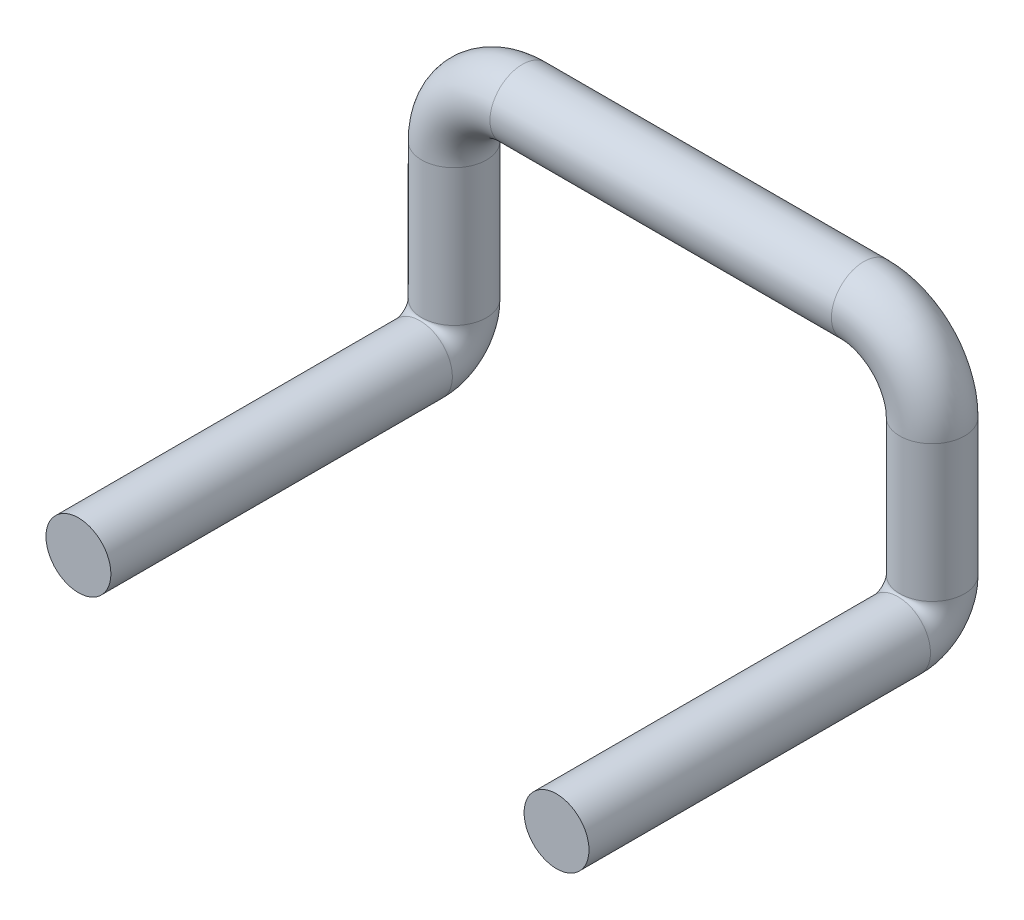
ISO-10303-21;
HEADER;
FILE_DESCRIPTION(('STEP AP214'),'2;1');
FILE_NAME('part.step','',(''),(''),'','','');
FILE_SCHEMA(('AUTOMOTIVE_DESIGN { 1 0 10303 214 1 1 1 1 }'));
ENDSEC;
DATA;
#1=APPLICATION_CONTEXT('core data for automotive mechanical design processes');
#2=APPLICATION_PROTOCOL_DEFINITION('international standard','automotive_design',2000,#1);
#3=PRODUCT_CONTEXT('',#1,'mechanical');
#4=PRODUCT('Part','Part','',(#3));
#5=PRODUCT_RELATED_PRODUCT_CATEGORY('part','',(#4));
#6=PRODUCT_DEFINITION_FORMATION('','',#4);
#7=PRODUCT_DEFINITION_CONTEXT('part definition',#1,'design');
#8=PRODUCT_DEFINITION('design','',#6,#7);
#9=PRODUCT_DEFINITION_SHAPE('','',#8);
#10=(LENGTH_UNIT() NAMED_UNIT(*) SI_UNIT(.MILLI.,.METRE.));
#11=(NAMED_UNIT(*) PLANE_ANGLE_UNIT() SI_UNIT($,.RADIAN.));
#12=(NAMED_UNIT(*) SI_UNIT($,.STERADIAN.) SOLID_ANGLE_UNIT());
#13=UNCERTAINTY_MEASURE_WITH_UNIT(LENGTH_MEASURE(1.E-05),#10,'distance_accuracy_value','');
#14=(GEOMETRIC_REPRESENTATION_CONTEXT(3) GLOBAL_UNCERTAINTY_ASSIGNED_CONTEXT((#13)) GLOBAL_UNIT_ASSIGNED_CONTEXT((#10,
#11,#12)) REPRESENTATION_CONTEXT('',''));
#15=CARTESIAN_POINT('',(0.,0.,0.));
#16=DIRECTION('',(0.,0.,1.));
#17=DIRECTION('',(1.,0.,0.));
#18=AXIS2_PLACEMENT_3D('',#15,#16,#17);
#19=CARTESIAN_POINT('',(0.,0.,0.));
#20=DIRECTION('',(0.,1.,0.));
#21=DIRECTION('',(0.,0.,1.));
#22=AXIS2_PLACEMENT_3D('',#19,#20,#21);
#23=CYLINDRICAL_SURFACE('',#22,0.95);
#24=CARTESIAN_POINT('',(0.,4.,0.));
#25=DIRECTION('',(0.,-1.,0.));
#26=DIRECTION('',(0.,0.,1.));
#27=AXIS2_PLACEMENT_3D('',#24,#25,#26);
#28=CIRCLE('',#27,0.95);
#29=CARTESIAN_POINT('',(-0.950000000000001,4.,0.));
#30=VERTEX_POINT('',#29);
#31=EDGE_CURVE('E91',#30,#30,#28,.T.);
#32=ORIENTED_EDGE('',*,*,#31,.T.);
#33=EDGE_LOOP('',(#32));
#34=FACE_BOUND('',#33,.T.);
#35=CARTESIAN_POINT('',(0.,0.,0.));
#36=DIRECTION('',(0.,-1.,0.));
#37=DIRECTION('',(0.,0.,1.));
#38=AXIS2_PLACEMENT_3D('',#35,#36,#37);
#39=CIRCLE('',#38,0.95);
#40=CARTESIAN_POINT('',(0.,0.,-0.95));
#41=VERTEX_POINT('',#40);
#42=EDGE_CURVE('E97',#41,#41,#39,.T.);
#43=ORIENTED_EDGE('',*,*,#42,.F.);
#44=EDGE_LOOP('',(#43));
#45=FACE_BOUND('',#44,.T.);
#46=ADVANCED_FACE('F73',(#34,#45),#23,.T.);
#47=CARTESIAN_POINT('',(2.,4.,0.));
#48=DIRECTION('',(0.,0.,-1.));
#49=DIRECTION('',(-1.,0.,0.));
#50=AXIS2_PLACEMENT_3D('',#47,#48,#49);
#51=TOROIDAL_SURFACE('',#50,2.,0.95);
#52=CARTESIAN_POINT('',(2.,6.,0.));
#53=DIRECTION('',(-1.,0.,0.));
#54=DIRECTION('',(0.,0.,1.));
#55=AXIS2_PLACEMENT_3D('',#52,#53,#54);
#56=CIRCLE('',#55,0.95);
#57=CARTESIAN_POINT('',(2.,6.95,0.));
#58=VERTEX_POINT('',#57);
#59=EDGE_CURVE('E86',#58,#58,#56,.T.);
#60=CARTESIAN_POINT('',(2.,4.,0.));
#61=DIRECTION('',(0.,0.,-1.));
#62=DIRECTION('',(-1.,0.,0.));
#63=AXIS2_PLACEMENT_3D('',#60,#61,#62);
#64=CIRCLE('',#63,2.95);
#65=EDGE_CURVE('',#30,#58,#64,.T.);
#66=ORIENTED_EDGE('',*,*,#31,.F.);
#67=ORIENTED_EDGE('',*,*,#59,.T.);
#68=ORIENTED_EDGE('',*,*,#65,.T.);
#69=ORIENTED_EDGE('',*,*,#65,.F.);
#70=EDGE_LOOP('',(#66,#68,#67,#69));
#71=FACE_BOUND('',#70,.T.);
#72=ADVANCED_FACE('F162',(#71),#51,.T.);
#73=CARTESIAN_POINT('',(2.,6.,0.));
#74=DIRECTION('',(1.,0.,0.));
#75=DIRECTION('',(0.,0.,-1.));
#76=AXIS2_PLACEMENT_3D('',#73,#74,#75);
#77=CYLINDRICAL_SURFACE('',#76,0.95);
#78=CARTESIAN_POINT('',(12.,6.,0.));
#79=DIRECTION('',(-1.,0.,0.));
#80=DIRECTION('',(0.,0.,1.));
#81=AXIS2_PLACEMENT_3D('',#78,#79,#80);
#82=CIRCLE('',#81,0.95);
#83=CARTESIAN_POINT('',(12.,6.95,0.));
#84=VERTEX_POINT('',#83);
#85=EDGE_CURVE('E81',#84,#84,#82,.T.);
#86=ORIENTED_EDGE('',*,*,#85,.T.);
#87=EDGE_LOOP('',(#86));
#88=FACE_BOUND('',#87,.T.);
#89=ORIENTED_EDGE('',*,*,#59,.F.);
#90=EDGE_LOOP('',(#89));
#91=FACE_BOUND('',#90,.T.);
#92=ADVANCED_FACE('F146',(#88,#91),#77,.T.);
#93=CARTESIAN_POINT('',(12.,4.,0.));
#94=DIRECTION('',(0.,0.,-1.));
#95=DIRECTION('',(-1.,0.,0.));
#96=AXIS2_PLACEMENT_3D('',#93,#94,#95);
#97=TOROIDAL_SURFACE('',#96,2.,0.95);
#98=CARTESIAN_POINT('',(14.,4.00000000000001,0.));
#99=DIRECTION('',(0.,1.,0.));
#100=DIRECTION('',(0.,0.,1.));
#101=AXIS2_PLACEMENT_3D('',#98,#99,#100);
#102=CIRCLE('',#101,0.95);
#103=CARTESIAN_POINT('',(14.95,4.00000000000001,0.));
#104=VERTEX_POINT('',#103);
#105=EDGE_CURVE('E11',#104,#104,#102,.T.);
#106=CARTESIAN_POINT('',(12.,4.,0.));
#107=DIRECTION('',(0.,0.,-1.));
#108=DIRECTION('',(-1.,0.,0.));
#109=AXIS2_PLACEMENT_3D('',#106,#107,#108);
#110=CIRCLE('',#109,2.95);
#111=EDGE_CURVE('',#84,#104,#110,.T.);
#112=ORIENTED_EDGE('',*,*,#85,.F.);
#113=ORIENTED_EDGE('',*,*,#105,.T.);
#114=ORIENTED_EDGE('',*,*,#111,.T.);
#115=ORIENTED_EDGE('',*,*,#111,.F.);
#116=EDGE_LOOP('',(#112,#114,#113,#115));
#117=FACE_BOUND('',#116,.T.);
#118=ADVANCED_FACE('F141',(#117),#97,.T.);
#119=CARTESIAN_POINT('',(14.,4.,0.));
#120=DIRECTION('',(0.,-1.,0.));
#121=DIRECTION('',(1.,0.,0.));
#122=AXIS2_PLACEMENT_3D('',#119,#120,#121);
#123=CYLINDRICAL_SURFACE('',#122,0.95);
#124=CARTESIAN_POINT('',(14.,0.,0.));
#125=DIRECTION('',(0.,1.,0.));
#126=DIRECTION('',(0.,0.,1.));
#127=AXIS2_PLACEMENT_3D('',#124,#125,#126);
#128=CIRCLE('',#127,0.95);
#129=CARTESIAN_POINT('',(14.,0.,-0.95));
#130=VERTEX_POINT('',#129);
#131=EDGE_CURVE('E109',#130,#130,#128,.T.);
#132=ORIENTED_EDGE('',*,*,#131,.T.);
#133=EDGE_LOOP('',(#132));
#134=FACE_BOUND('',#133,.T.);
#135=ORIENTED_EDGE('',*,*,#105,.F.);
#136=EDGE_LOOP('',(#135));
#137=FACE_BOUND('',#136,.T.);
#138=ADVANCED_FACE('F75',(#134,#137),#123,.T.);
#139=CARTESIAN_POINT('',(14.,-0.999999999999995,11.));
#140=DIRECTION('',(0.,0.,-1.));
#141=DIRECTION('',(0.,1.,0.));
#142=AXIS2_PLACEMENT_3D('',#139,#140,#141);
#143=PLANE('',#142);
#144=CARTESIAN_POINT('',(14.,-0.999999999999995,11.));
#145=DIRECTION('',(0.,0.,-1.));
#146=DIRECTION('',(0.,1.,0.));
#147=AXIS2_PLACEMENT_3D('',#144,#145,#146);
#148=CIRCLE('',#147,0.95);
#149=CARTESIAN_POINT('',(14.,-0.0499999999999958,11.));
#150=VERTEX_POINT('',#149);
#151=EDGE_CURVE('E101',#150,#150,#148,.T.);
#152=ORIENTED_EDGE('',*,*,#151,.F.);
#153=EDGE_LOOP('',(#152));
#154=FACE_BOUND('',#153,.T.);
#155=ADVANCED_FACE('F129',(#154),#143,.F.);
#156=CARTESIAN_POINT('',(14.,0.,1.));
#157=DIRECTION('',(-1.,0.,0.));
#158=DIRECTION('',(0.,-1.,0.));
#159=AXIS2_PLACEMENT_3D('',#156,#157,#158);
#160=TOROIDAL_SURFACE('',#159,1.,0.95);
#161=CARTESIAN_POINT('',(14.,-0.999999999999995,1.));
#162=DIRECTION('',(0.,0.,-1.));
#163=DIRECTION('',(0.,1.,0.));
#164=AXIS2_PLACEMENT_3D('',#161,#162,#163);
#165=CIRCLE('',#164,0.95);
#166=CARTESIAN_POINT('',(14.,-1.94999999999999,1.00000000000001));
#167=VERTEX_POINT('',#166);
#168=EDGE_CURVE('E105',#167,#167,#165,.T.);
#169=CARTESIAN_POINT('',(14.,0.,1.));
#170=DIRECTION('',(-1.,0.,0.));
#171=DIRECTION('',(0.,-1.,0.));
#172=AXIS2_PLACEMENT_3D('',#169,#170,#171);
#173=CIRCLE('',#172,1.95);
#174=EDGE_CURVE('',#130,#167,#173,.T.);
#175=ORIENTED_EDGE('',*,*,#131,.F.);
#176=ORIENTED_EDGE('',*,*,#168,.T.);
#177=ORIENTED_EDGE('',*,*,#174,.T.);
#178=ORIENTED_EDGE('',*,*,#174,.F.);
#179=EDGE_LOOP('',(#175,#177,#176,#178));
#180=FACE_BOUND('',#179,.T.);
#181=ADVANCED_FACE('F137',(#180),#160,.T.);
#182=CARTESIAN_POINT('',(14.,-0.999999999999994,1.));
#183=DIRECTION('',(0.,0.,1.));
#184=DIRECTION('',(0.,-1.,0.));
#185=AXIS2_PLACEMENT_3D('',#182,#183,#184);
#186=CYLINDRICAL_SURFACE('',#185,0.95);
#187=ORIENTED_EDGE('',*,*,#151,.T.);
#188=EDGE_LOOP('',(#187));
#189=FACE_BOUND('',#188,.T.);
#190=ORIENTED_EDGE('',*,*,#168,.F.);
#191=EDGE_LOOP('',(#190));
#192=FACE_BOUND('',#191,.T.);
#193=ADVANCED_FACE('F151',(#189,#192),#186,.T.);
#194=CARTESIAN_POINT('',(0.,-1.,11.));
#195=DIRECTION('',(0.,0.,-1.));
#196=DIRECTION('',(0.,1.,0.));
#197=AXIS2_PLACEMENT_3D('',#194,#195,#196);
#198=PLANE('',#197);
#199=CARTESIAN_POINT('',(0.,-1.,11.));
#200=DIRECTION('',(0.,0.,-1.));
#201=DIRECTION('',(0.,1.,0.));
#202=AXIS2_PLACEMENT_3D('',#199,#200,#201);
#203=CIRCLE('',#202,0.95);
#204=CARTESIAN_POINT('',(0.,-0.0500000000000013,11.));
#205=VERTEX_POINT('',#204);
#206=EDGE_CURVE('E113',#205,#205,#203,.T.);
#207=ORIENTED_EDGE('',*,*,#206,.F.);
#208=EDGE_LOOP('',(#207));
#209=FACE_BOUND('',#208,.T.);
#210=ADVANCED_FACE('F133',(#209),#198,.F.);
#211=CARTESIAN_POINT('',(0.,0.,1.));
#212=DIRECTION('',(-1.,0.,0.));
#213=DIRECTION('',(0.,0.,1.));
#214=AXIS2_PLACEMENT_3D('',#211,#212,#213);
#215=TOROIDAL_SURFACE('',#214,1.,0.95);
#216=CARTESIAN_POINT('',(0.,-0.999999999999999,1.));
#217=DIRECTION('',(0.,0.,-1.));
#218=DIRECTION('',(0.,1.,0.));
#219=AXIS2_PLACEMENT_3D('',#216,#217,#218);
#220=CIRCLE('',#219,0.95);
#221=CARTESIAN_POINT('',(0.,-1.95,1.));
#222=VERTEX_POINT('',#221);
#223=EDGE_CURVE('E117',#222,#222,#220,.T.);
#224=CARTESIAN_POINT('',(0.,0.,1.));
#225=DIRECTION('',(-1.,0.,0.));
#226=DIRECTION('',(0.,0.,1.));
#227=AXIS2_PLACEMENT_3D('',#224,#225,#226);
#228=CIRCLE('',#227,1.95);
#229=EDGE_CURVE('',#41,#222,#228,.T.);
#230=ORIENTED_EDGE('',*,*,#42,.T.);
#231=ORIENTED_EDGE('',*,*,#223,.T.);
#232=ORIENTED_EDGE('',*,*,#229,.T.);
#233=ORIENTED_EDGE('',*,*,#229,.F.);
#234=EDGE_LOOP('',(#230,#232,#231,#233));
#235=FACE_BOUND('',#234,.T.);
#236=ADVANCED_FACE('F122',(#235),#215,.T.);
#237=CARTESIAN_POINT('',(0.,-1.,1.));
#238=DIRECTION('',(0.,0.,1.));
#239=DIRECTION('',(0.,-1.,0.));
#240=AXIS2_PLACEMENT_3D('',#237,#238,#239);
#241=CYLINDRICAL_SURFACE('',#240,0.95);
#242=ORIENTED_EDGE('',*,*,#206,.T.);
#243=EDGE_LOOP('',(#242));
#244=FACE_BOUND('',#243,.T.);
#245=ORIENTED_EDGE('',*,*,#223,.F.);
#246=EDGE_LOOP('',(#245));
#247=FACE_BOUND('',#246,.T.);
#248=ADVANCED_FACE('F125',(#244,#247),#241,.T.);
#249=CLOSED_SHELL('',(#46,#72,#92,#118,#138,#155,#181,#193,#210,#236,#248));
#250=MANIFOLD_SOLID_BREP('B2',#249);
#251=ADVANCED_BREP_SHAPE_REPRESENTATION('',(#18,#250),#14);
#252=SHAPE_DEFINITION_REPRESENTATION(#9,#251);
ENDSEC;
END-ISO-10303-21;
